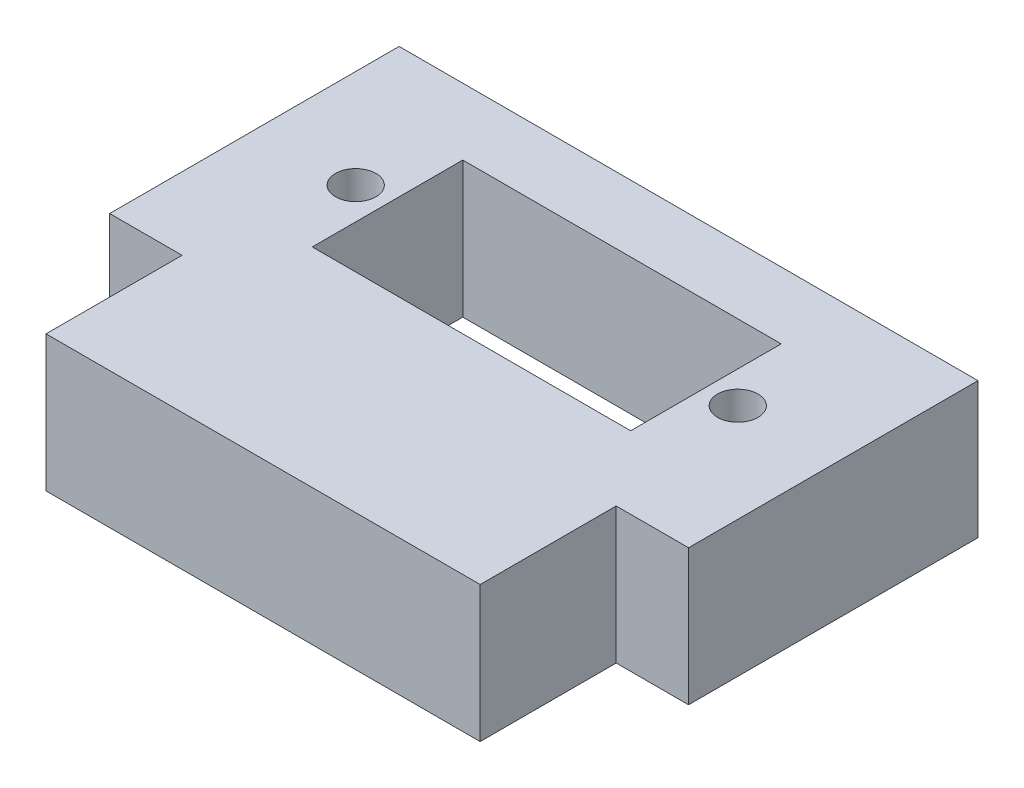
ISO-10303-21;
HEADER;
FILE_DESCRIPTION(('STEP AP214'),'2;1');
FILE_NAME('part.step','',(''),(''),'','','');
FILE_SCHEMA(('AUTOMOTIVE_DESIGN { 1 0 10303 214 1 1 1 1 }'));
ENDSEC;
DATA;
#1=APPLICATION_CONTEXT('core data for automotive mechanical design processes');
#2=APPLICATION_PROTOCOL_DEFINITION('international standard','automotive_design',2000,#1);
#3=PRODUCT_CONTEXT('',#1,'mechanical');
#4=PRODUCT('Part','Part','',(#3));
#5=PRODUCT_RELATED_PRODUCT_CATEGORY('part','',(#4));
#6=PRODUCT_DEFINITION_FORMATION('','',#4);
#7=PRODUCT_DEFINITION_CONTEXT('part definition',#1,'design');
#8=PRODUCT_DEFINITION('design','',#6,#7);
#9=PRODUCT_DEFINITION_SHAPE('','',#8);
#10=(LENGTH_UNIT() NAMED_UNIT(*) SI_UNIT(.MILLI.,.METRE.));
#11=(NAMED_UNIT(*) PLANE_ANGLE_UNIT() SI_UNIT($,.RADIAN.));
#12=(NAMED_UNIT(*) SI_UNIT($,.STERADIAN.) SOLID_ANGLE_UNIT());
#13=UNCERTAINTY_MEASURE_WITH_UNIT(LENGTH_MEASURE(1.E-05),#10,'distance_accuracy_value','');
#14=(GEOMETRIC_REPRESENTATION_CONTEXT(3) GLOBAL_UNCERTAINTY_ASSIGNED_CONTEXT((#13)) GLOBAL_UNIT_ASSIGNED_CONTEXT((#10,
#11,#12)) REPRESENTATION_CONTEXT('',''));
#15=CARTESIAN_POINT('',(0.,0.,0.));
#16=DIRECTION('',(0.,0.,1.));
#17=DIRECTION('',(1.,0.,0.));
#18=AXIS2_PLACEMENT_3D('',#15,#16,#17);
#19=CARTESIAN_POINT('',(0.,11.938,0.));
#20=DIRECTION('',(1.,0.,0.));
#21=DIRECTION('',(0.,0.,-1.));
#22=AXIS2_PLACEMENT_3D('',#19,#20,#21);
#23=PLANE('',#22);
#24=DIRECTION('',(0.,0.,1.));
#25=VECTOR('',#24,1.);
#26=CARTESIAN_POINT('',(0.,0.,0.));
#27=LINE('',#26,#25);
#28=CARTESIAN_POINT('',(0.,0.,-25.4));
#29=VERTEX_POINT('',#28);
#30=CARTESIAN_POINT('',(0.,0.,0.));
#31=VERTEX_POINT('',#30);
#32=EDGE_CURVE('E160',#29,#31,#27,.T.);
#33=ORIENTED_EDGE('',*,*,#32,.T.);
#34=DIRECTION('',(0.,-1.,0.));
#35=VECTOR('',#34,1.);
#36=CARTESIAN_POINT('',(0.,11.938,0.));
#37=LINE('',#36,#35);
#38=CARTESIAN_POINT('',(0.,11.938,0.));
#39=VERTEX_POINT('',#38);
#40=EDGE_CURVE('E11',#39,#31,#37,.T.);
#41=ORIENTED_EDGE('',*,*,#40,.F.);
#42=DIRECTION('',(0.,0.,1.));
#43=VECTOR('',#42,1.);
#44=CARTESIAN_POINT('',(0.,11.938,0.));
#45=LINE('',#44,#43);
#46=CARTESIAN_POINT('',(0.,11.938,-25.4));
#47=VERTEX_POINT('',#46);
#48=EDGE_CURVE('E164',#47,#39,#45,.T.);
#49=ORIENTED_EDGE('',*,*,#48,.F.);
#50=DIRECTION('',(0.,-1.,0.));
#51=VECTOR('',#50,1.);
#52=CARTESIAN_POINT('',(0.,11.938,-25.4));
#53=LINE('',#52,#51);
#54=EDGE_CURVE('E182',#47,#29,#53,.T.);
#55=ORIENTED_EDGE('',*,*,#54,.T.);
#56=EDGE_LOOP('',(#33,#41,#49,#55));
#57=FACE_BOUND('',#56,.T.);
#58=ADVANCED_FACE('F35',(#57),#23,.F.);
#59=CARTESIAN_POINT('',(0.,11.938,0.));
#60=DIRECTION('',(0.,0.,-1.));
#61=DIRECTION('',(-1.,0.,0.));
#62=AXIS2_PLACEMENT_3D('',#59,#60,#61);
#63=PLANE('',#62);
#64=DIRECTION('',(1.,0.,0.));
#65=VECTOR('',#64,1.);
#66=CARTESIAN_POINT('',(0.,0.,0.));
#67=LINE('',#66,#65);
#68=CARTESIAN_POINT('',(6.35,0.,0.));
#69=VERTEX_POINT('',#68);
#70=EDGE_CURVE('E185',#31,#69,#67,.T.);
#71=ORIENTED_EDGE('',*,*,#70,.T.);
#72=DIRECTION('',(0.,-1.,0.));
#73=VECTOR('',#72,1.);
#74=CARTESIAN_POINT('',(6.35,11.938,0.));
#75=LINE('',#74,#73);
#76=CARTESIAN_POINT('',(6.35,11.938,0.));
#77=VERTEX_POINT('',#76);
#78=EDGE_CURVE('E42',#77,#69,#75,.T.);
#79=ORIENTED_EDGE('',*,*,#78,.F.);
#80=DIRECTION('',(1.,0.,0.));
#81=VECTOR('',#80,1.);
#82=CARTESIAN_POINT('',(0.,11.938,0.));
#83=LINE('',#82,#81);
#84=EDGE_CURVE('E167',#39,#77,#83,.T.);
#85=ORIENTED_EDGE('',*,*,#84,.F.);
#86=ORIENTED_EDGE('',*,*,#40,.T.);
#87=EDGE_LOOP('',(#71,#79,#85,#86));
#88=FACE_BOUND('',#87,.T.);
#89=ADVANCED_FACE('F240',(#88),#63,.F.);
#90=CARTESIAN_POINT('',(6.35,11.938,0.));
#91=DIRECTION('',(1.,0.,0.));
#92=DIRECTION('',(0.,0.,-1.));
#93=AXIS2_PLACEMENT_3D('',#90,#91,#92);
#94=PLANE('',#93);
#95=DIRECTION('',(0.,0.,1.));
#96=VECTOR('',#95,1.);
#97=CARTESIAN_POINT('',(6.35,0.,0.));
#98=LINE('',#97,#96);
#99=CARTESIAN_POINT('',(6.35,0.,11.938));
#100=VERTEX_POINT('',#99);
#101=EDGE_CURVE('E187',#69,#100,#98,.T.);
#102=ORIENTED_EDGE('',*,*,#101,.T.);
#103=DIRECTION('',(0.,-1.,0.));
#104=VECTOR('',#103,1.);
#105=CARTESIAN_POINT('',(6.35,11.938,11.938));
#106=LINE('',#105,#104);
#107=CARTESIAN_POINT('',(6.35,11.938,11.938));
#108=VERTEX_POINT('',#107);
#109=EDGE_CURVE('E212',#108,#100,#106,.T.);
#110=ORIENTED_EDGE('',*,*,#109,.F.);
#111=DIRECTION('',(0.,0.,1.));
#112=VECTOR('',#111,1.);
#113=CARTESIAN_POINT('',(6.35,11.938,0.));
#114=LINE('',#113,#112);
#115=EDGE_CURVE('E170',#77,#108,#114,.T.);
#116=ORIENTED_EDGE('',*,*,#115,.F.);
#117=ORIENTED_EDGE('',*,*,#78,.T.);
#118=EDGE_LOOP('',(#102,#110,#116,#117));
#119=FACE_BOUND('',#118,.T.);
#120=ADVANCED_FACE('F219',(#119),#94,.F.);
#121=CARTESIAN_POINT('',(6.35,11.938,11.938));
#122=DIRECTION('',(0.,0.,-1.));
#123=DIRECTION('',(-1.,0.,0.));
#124=AXIS2_PLACEMENT_3D('',#121,#122,#123);
#125=PLANE('',#124);
#126=DIRECTION('',(1.,0.,0.));
#127=VECTOR('',#126,1.);
#128=CARTESIAN_POINT('',(6.35,0.,11.938));
#129=LINE('',#128,#127);
#130=CARTESIAN_POINT('',(44.45,0.,11.938));
#131=VERTEX_POINT('',#130);
#132=EDGE_CURVE('E189',#100,#131,#129,.T.);
#133=ORIENTED_EDGE('',*,*,#132,.T.);
#134=DIRECTION('',(0.,-1.,0.));
#135=VECTOR('',#134,1.);
#136=CARTESIAN_POINT('',(44.45,11.938,11.938));
#137=LINE('',#136,#135);
#138=CARTESIAN_POINT('',(44.45,11.938,11.938));
#139=VERTEX_POINT('',#138);
#140=EDGE_CURVE('E209',#139,#131,#137,.T.);
#141=ORIENTED_EDGE('',*,*,#140,.F.);
#142=DIRECTION('',(1.,0.,0.));
#143=VECTOR('',#142,1.);
#144=CARTESIAN_POINT('',(6.35,11.938,11.938));
#145=LINE('',#144,#143);
#146=EDGE_CURVE('E172',#108,#139,#145,.T.);
#147=ORIENTED_EDGE('',*,*,#146,.F.);
#148=ORIENTED_EDGE('',*,*,#109,.T.);
#149=EDGE_LOOP('',(#133,#141,#147,#148));
#150=FACE_BOUND('',#149,.T.);
#151=ADVANCED_FACE('F228',(#150),#125,.F.);
#152=CARTESIAN_POINT('',(44.45,11.938,0.));
#153=DIRECTION('',(-1.,0.,0.));
#154=DIRECTION('',(0.,0.,1.));
#155=AXIS2_PLACEMENT_3D('',#152,#153,#154);
#156=PLANE('',#155);
#157=DIRECTION('',(0.,0.,-1.));
#158=VECTOR('',#157,1.);
#159=CARTESIAN_POINT('',(44.45,0.,0.));
#160=LINE('',#159,#158);
#161=CARTESIAN_POINT('',(44.45,0.,0.));
#162=VERTEX_POINT('',#161);
#163=EDGE_CURVE('E191',#131,#162,#160,.T.);
#164=ORIENTED_EDGE('',*,*,#163,.T.);
#165=DIRECTION('',(0.,-1.,0.));
#166=VECTOR('',#165,1.);
#167=CARTESIAN_POINT('',(44.45,11.938,0.));
#168=LINE('',#167,#166);
#169=CARTESIAN_POINT('',(44.45,11.938,0.));
#170=VERTEX_POINT('',#169);
#171=EDGE_CURVE('E206',#170,#162,#168,.T.);
#172=ORIENTED_EDGE('',*,*,#171,.F.);
#173=DIRECTION('',(0.,0.,-1.));
#174=VECTOR('',#173,1.);
#175=CARTESIAN_POINT('',(44.45,11.938,0.));
#176=LINE('',#175,#174);
#177=EDGE_CURVE('E174',#139,#170,#176,.T.);
#178=ORIENTED_EDGE('',*,*,#177,.F.);
#179=ORIENTED_EDGE('',*,*,#140,.T.);
#180=EDGE_LOOP('',(#164,#172,#178,#179));
#181=FACE_BOUND('',#180,.T.);
#182=ADVANCED_FACE('F232',(#181),#156,.F.);
#183=CARTESIAN_POINT('',(44.45,11.938,0.));
#184=DIRECTION('',(0.,0.,-1.));
#185=DIRECTION('',(-1.,0.,0.));
#186=AXIS2_PLACEMENT_3D('',#183,#184,#185);
#187=PLANE('',#186);
#188=DIRECTION('',(1.,0.,0.));
#189=VECTOR('',#188,1.);
#190=CARTESIAN_POINT('',(44.45,0.,0.));
#191=LINE('',#190,#189);
#192=CARTESIAN_POINT('',(50.8,0.,0.));
#193=VERTEX_POINT('',#192);
#194=EDGE_CURVE('E193',#162,#193,#191,.T.);
#195=ORIENTED_EDGE('',*,*,#194,.T.);
#196=DIRECTION('',(0.,-1.,0.));
#197=VECTOR('',#196,1.);
#198=CARTESIAN_POINT('',(50.8,11.938,0.));
#199=LINE('',#198,#197);
#200=CARTESIAN_POINT('',(50.8,11.938,0.));
#201=VERTEX_POINT('',#200);
#202=EDGE_CURVE('E203',#201,#193,#199,.T.);
#203=ORIENTED_EDGE('',*,*,#202,.F.);
#204=DIRECTION('',(1.,0.,0.));
#205=VECTOR('',#204,1.);
#206=CARTESIAN_POINT('',(44.45,11.938,0.));
#207=LINE('',#206,#205);
#208=EDGE_CURVE('E176',#170,#201,#207,.T.);
#209=ORIENTED_EDGE('',*,*,#208,.F.);
#210=ORIENTED_EDGE('',*,*,#171,.T.);
#211=EDGE_LOOP('',(#195,#203,#209,#210));
#212=FACE_BOUND('',#211,.T.);
#213=ADVANCED_FACE('F253',(#212),#187,.F.);
#214=CARTESIAN_POINT('',(50.8,11.938,0.));
#215=DIRECTION('',(-1.,0.,0.));
#216=DIRECTION('',(0.,0.,1.));
#217=AXIS2_PLACEMENT_3D('',#214,#215,#216);
#218=PLANE('',#217);
#219=DIRECTION('',(0.,0.,-1.));
#220=VECTOR('',#219,1.);
#221=CARTESIAN_POINT('',(50.8,0.,0.));
#222=LINE('',#221,#220);
#223=CARTESIAN_POINT('',(50.8,0.,-25.4));
#224=VERTEX_POINT('',#223);
#225=EDGE_CURVE('E195',#193,#224,#222,.T.);
#226=ORIENTED_EDGE('',*,*,#225,.T.);
#227=DIRECTION('',(0.,-1.,0.));
#228=VECTOR('',#227,1.);
#229=CARTESIAN_POINT('',(50.8,11.938,-25.4));
#230=LINE('',#229,#228);
#231=CARTESIAN_POINT('',(50.8,11.938,-25.4));
#232=VERTEX_POINT('',#231);
#233=EDGE_CURVE('E200',#232,#224,#230,.T.);
#234=ORIENTED_EDGE('',*,*,#233,.F.);
#235=DIRECTION('',(0.,0.,-1.));
#236=VECTOR('',#235,1.);
#237=CARTESIAN_POINT('',(50.8,11.938,0.));
#238=LINE('',#237,#236);
#239=EDGE_CURVE('E178',#201,#232,#238,.T.);
#240=ORIENTED_EDGE('',*,*,#239,.F.);
#241=ORIENTED_EDGE('',*,*,#202,.T.);
#242=EDGE_LOOP('',(#226,#234,#240,#241));
#243=FACE_BOUND('',#242,.T.);
#244=ADVANCED_FACE('F251',(#243),#218,.F.);
#245=CARTESIAN_POINT('',(0.,11.938,-25.4));
#246=DIRECTION('',(0.,0.,1.));
#247=DIRECTION('',(1.,0.,0.));
#248=AXIS2_PLACEMENT_3D('',#245,#246,#247);
#249=PLANE('',#248);
#250=DIRECTION('',(-1.,0.,0.));
#251=VECTOR('',#250,1.);
#252=CARTESIAN_POINT('',(0.,0.,-25.4));
#253=LINE('',#252,#251);
#254=EDGE_CURVE('E168',#224,#29,#253,.T.);
#255=ORIENTED_EDGE('',*,*,#254,.T.);
#256=ORIENTED_EDGE('',*,*,#54,.F.);
#257=DIRECTION('',(-1.,0.,0.));
#258=VECTOR('',#257,1.);
#259=CARTESIAN_POINT('',(0.,11.938,-25.4));
#260=LINE('',#259,#258);
#261=EDGE_CURVE('E180',#232,#47,#260,.T.);
#262=ORIENTED_EDGE('',*,*,#261,.F.);
#263=ORIENTED_EDGE('',*,*,#233,.T.);
#264=EDGE_LOOP('',(#255,#256,#262,#263));
#265=FACE_BOUND('',#264,.T.);
#266=ADVANCED_FACE('F246',(#265),#249,.F.);
#267=CARTESIAN_POINT('',(0.,11.938,0.));
#268=DIRECTION('',(0.,-1.,0.));
#269=DIRECTION('',(0.,0.,-1.));
#270=AXIS2_PLACEMENT_3D('',#267,#268,#269);
#271=PLANE('',#270);
#272=CARTESIAN_POINT('',(8.636,11.938,-12.954));
#273=DIRECTION('',(0.,1.,0.));
#274=DIRECTION('',(0.,0.,1.));
#275=AXIS2_PLACEMENT_3D('',#272,#273,#274);
#276=CIRCLE('',#275,1.778);
#277=CARTESIAN_POINT('',(8.636,11.938,-11.176));
#278=VERTEX_POINT('',#277);
#279=EDGE_CURVE('E380',#278,#278,#276,.T.);
#280=ORIENTED_EDGE('',*,*,#279,.F.);
#281=EDGE_LOOP('',(#280));
#282=FACE_BOUND('',#281,.T.);
#283=CARTESIAN_POINT('',(42.164,11.938,-12.954));
#284=DIRECTION('',(0.,1.,0.));
#285=DIRECTION('',(0.,0.,-1.));
#286=AXIS2_PLACEMENT_3D('',#283,#284,#285);
#287=CIRCLE('',#286,1.778);
#288=CARTESIAN_POINT('',(42.164,11.938,-14.732));
#289=VERTEX_POINT('',#288);
#290=EDGE_CURVE('E147',#289,#289,#287,.T.);
#291=ORIENTED_EDGE('',*,*,#290,.F.);
#292=EDGE_LOOP('',(#291));
#293=FACE_BOUND('',#292,.T.);
#294=DIRECTION('',(-1.,0.,0.));
#295=VECTOR('',#294,1.);
#296=CARTESIAN_POINT('',(39.37,11.938,-19.558));
#297=LINE('',#296,#295);
#298=CARTESIAN_POINT('',(39.37,11.938,-19.558));
#299=VERTEX_POINT('',#298);
#300=CARTESIAN_POINT('',(11.43,11.938,-19.558));
#301=VERTEX_POINT('',#300);
#302=EDGE_CURVE('E153',#299,#301,#297,.T.);
#303=ORIENTED_EDGE('',*,*,#302,.F.);
#304=DIRECTION('',(0.,0.,-1.));
#305=VECTOR('',#304,1.);
#306=CARTESIAN_POINT('',(39.37,11.938,-6.35));
#307=LINE('',#306,#305);
#308=CARTESIAN_POINT('',(39.37,11.938,-6.35));
#309=VERTEX_POINT('',#308);
#310=EDGE_CURVE('E49',#309,#299,#307,.T.);
#311=ORIENTED_EDGE('',*,*,#310,.F.);
#312=DIRECTION('',(1.,0.,0.));
#313=VECTOR('',#312,1.);
#314=CARTESIAN_POINT('',(39.37,11.938,-6.35));
#315=LINE('',#314,#313);
#316=CARTESIAN_POINT('',(11.43,11.938,-6.35));
#317=VERTEX_POINT('',#316);
#318=EDGE_CURVE('E141',#317,#309,#315,.T.);
#319=ORIENTED_EDGE('',*,*,#318,.F.);
#320=DIRECTION('',(0.,0.,1.));
#321=VECTOR('',#320,1.);
#322=CARTESIAN_POINT('',(11.43,11.938,-6.35));
#323=LINE('',#322,#321);
#324=EDGE_CURVE('E144',#301,#317,#323,.T.);
#325=ORIENTED_EDGE('',*,*,#324,.F.);
#326=EDGE_LOOP('',(#303,#311,#319,#325));
#327=FACE_BOUND('',#326,.T.);
#328=ORIENTED_EDGE('',*,*,#48,.T.);
#329=ORIENTED_EDGE('',*,*,#84,.T.);
#330=ORIENTED_EDGE('',*,*,#115,.T.);
#331=ORIENTED_EDGE('',*,*,#146,.T.);
#332=ORIENTED_EDGE('',*,*,#177,.T.);
#333=ORIENTED_EDGE('',*,*,#208,.T.);
#334=ORIENTED_EDGE('',*,*,#239,.T.);
#335=ORIENTED_EDGE('',*,*,#261,.T.);
#336=EDGE_LOOP('',(#328,#329,#330,#331,#332,#333,#334,#335));
#337=FACE_BOUND('',#336,.T.);
#338=ADVANCED_FACE('F236',(#282,#293,#327,#337),#271,.F.);
#339=CARTESIAN_POINT('',(0.,0.,0.));
#340=DIRECTION('',(0.,-1.,0.));
#341=DIRECTION('',(0.,0.,-1.));
#342=AXIS2_PLACEMENT_3D('',#339,#340,#341);
#343=PLANE('',#342);
#344=CARTESIAN_POINT('',(8.636,0.,-12.954));
#345=DIRECTION('',(0.,1.,0.));
#346=DIRECTION('',(0.,0.,1.));
#347=AXIS2_PLACEMENT_3D('',#344,#345,#346);
#348=CIRCLE('',#347,1.778);
#349=CARTESIAN_POINT('',(8.636,0.,-11.176));
#350=VERTEX_POINT('',#349);
#351=EDGE_CURVE('E154',#350,#350,#348,.T.);
#352=ORIENTED_EDGE('',*,*,#351,.T.);
#353=EDGE_LOOP('',(#352));
#354=FACE_BOUND('',#353,.T.);
#355=CARTESIAN_POINT('',(42.164,0.,-12.954));
#356=DIRECTION('',(0.,1.,0.));
#357=DIRECTION('',(0.,0.,-1.));
#358=AXIS2_PLACEMENT_3D('',#355,#356,#357);
#359=CIRCLE('',#358,1.778);
#360=CARTESIAN_POINT('',(42.164,0.,-14.732));
#361=VERTEX_POINT('',#360);
#362=EDGE_CURVE('E381',#361,#361,#359,.T.);
#363=ORIENTED_EDGE('',*,*,#362,.T.);
#364=EDGE_LOOP('',(#363));
#365=FACE_BOUND('',#364,.T.);
#366=DIRECTION('',(0.,0.,-1.));
#367=VECTOR('',#366,1.);
#368=CARTESIAN_POINT('',(39.37,0.,-6.35));
#369=LINE('',#368,#367);
#370=CARTESIAN_POINT('',(39.37,0.,-6.35));
#371=VERTEX_POINT('',#370);
#372=CARTESIAN_POINT('',(39.37,0.,-19.558));
#373=VERTEX_POINT('',#372);
#374=EDGE_CURVE('E125',#371,#373,#369,.T.);
#375=ORIENTED_EDGE('',*,*,#374,.T.);
#376=DIRECTION('',(-1.,0.,0.));
#377=VECTOR('',#376,1.);
#378=CARTESIAN_POINT('',(39.37,0.,-19.558));
#379=LINE('',#378,#377);
#380=CARTESIAN_POINT('',(11.43,0.,-19.558));
#381=VERTEX_POINT('',#380);
#382=EDGE_CURVE('E134',#373,#381,#379,.T.);
#383=ORIENTED_EDGE('',*,*,#382,.T.);
#384=DIRECTION('',(0.,0.,1.));
#385=VECTOR('',#384,1.);
#386=CARTESIAN_POINT('',(11.43,0.,-6.35));
#387=LINE('',#386,#385);
#388=CARTESIAN_POINT('',(11.43,0.,-6.35));
#389=VERTEX_POINT('',#388);
#390=EDGE_CURVE('E57',#381,#389,#387,.T.);
#391=ORIENTED_EDGE('',*,*,#390,.T.);
#392=DIRECTION('',(1.,0.,0.));
#393=VECTOR('',#392,1.);
#394=CARTESIAN_POINT('',(39.37,0.,-6.35));
#395=LINE('',#394,#393);
#396=EDGE_CURVE('E131',#389,#371,#395,.T.);
#397=ORIENTED_EDGE('',*,*,#396,.T.);
#398=EDGE_LOOP('',(#375,#383,#391,#397));
#399=FACE_BOUND('',#398,.T.);
#400=ORIENTED_EDGE('',*,*,#32,.F.);
#401=ORIENTED_EDGE('',*,*,#254,.F.);
#402=ORIENTED_EDGE('',*,*,#225,.F.);
#403=ORIENTED_EDGE('',*,*,#194,.F.);
#404=ORIENTED_EDGE('',*,*,#163,.F.);
#405=ORIENTED_EDGE('',*,*,#132,.F.);
#406=ORIENTED_EDGE('',*,*,#101,.F.);
#407=ORIENTED_EDGE('',*,*,#70,.F.);
#408=EDGE_LOOP('',(#400,#401,#402,#403,#404,#405,#406,#407));
#409=FACE_BOUND('',#408,.T.);
#410=ADVANCED_FACE('F138',(#354,#365,#399,#409),#343,.T.);
#411=CARTESIAN_POINT('',(39.37,0.,-6.35));
#412=DIRECTION('',(1.,0.,0.));
#413=DIRECTION('',(0.,0.,-1.));
#414=AXIS2_PLACEMENT_3D('',#411,#412,#413);
#415=PLANE('',#414);
#416=ORIENTED_EDGE('',*,*,#310,.T.);
#417=DIRECTION('',(0.,1.,0.));
#418=VECTOR('',#417,1.);
#419=CARTESIAN_POINT('',(39.37,0.,-19.558));
#420=LINE('',#419,#418);
#421=EDGE_CURVE('E121',#373,#299,#420,.T.);
#422=ORIENTED_EDGE('',*,*,#421,.F.);
#423=ORIENTED_EDGE('',*,*,#374,.F.);
#424=DIRECTION('',(0.,1.,0.));
#425=VECTOR('',#424,1.);
#426=CARTESIAN_POINT('',(39.37,0.,-6.35));
#427=LINE('',#426,#425);
#428=EDGE_CURVE('E158',#371,#309,#427,.T.);
#429=ORIENTED_EDGE('',*,*,#428,.T.);
#430=EDGE_LOOP('',(#416,#422,#423,#429));
#431=FACE_BOUND('',#430,.T.);
#432=ADVANCED_FACE('F123',(#431),#415,.F.);
#433=CARTESIAN_POINT('',(39.37,0.,-6.35));
#434=DIRECTION('',(0.,0.,1.));
#435=DIRECTION('',(1.,0.,0.));
#436=AXIS2_PLACEMENT_3D('',#433,#434,#435);
#437=PLANE('',#436);
#438=ORIENTED_EDGE('',*,*,#318,.T.);
#439=ORIENTED_EDGE('',*,*,#428,.F.);
#440=ORIENTED_EDGE('',*,*,#396,.F.);
#441=DIRECTION('',(0.,1.,0.));
#442=VECTOR('',#441,1.);
#443=CARTESIAN_POINT('',(11.43,0.,-6.35));
#444=LINE('',#443,#442);
#445=EDGE_CURVE('E161',#389,#317,#444,.T.);
#446=ORIENTED_EDGE('',*,*,#445,.T.);
#447=EDGE_LOOP('',(#438,#439,#440,#446));
#448=FACE_BOUND('',#447,.T.);
#449=ADVANCED_FACE('F309',(#448),#437,.F.);
#450=CARTESIAN_POINT('',(11.43,0.,-6.35));
#451=DIRECTION('',(-1.,0.,0.));
#452=DIRECTION('',(0.,0.,1.));
#453=AXIS2_PLACEMENT_3D('',#450,#451,#452);
#454=PLANE('',#453);
#455=ORIENTED_EDGE('',*,*,#324,.T.);
#456=ORIENTED_EDGE('',*,*,#445,.F.);
#457=ORIENTED_EDGE('',*,*,#390,.F.);
#458=DIRECTION('',(0.,1.,0.));
#459=VECTOR('',#458,1.);
#460=CARTESIAN_POINT('',(11.43,0.,-19.558));
#461=LINE('',#460,#459);
#462=EDGE_CURVE('E130',#381,#301,#461,.T.);
#463=ORIENTED_EDGE('',*,*,#462,.T.);
#464=EDGE_LOOP('',(#455,#456,#457,#463));
#465=FACE_BOUND('',#464,.T.);
#466=ADVANCED_FACE('F320',(#465),#454,.F.);
#467=CARTESIAN_POINT('',(39.37,0.,-19.558));
#468=DIRECTION('',(0.,0.,-1.));
#469=DIRECTION('',(-1.,0.,0.));
#470=AXIS2_PLACEMENT_3D('',#467,#468,#469);
#471=PLANE('',#470);
#472=ORIENTED_EDGE('',*,*,#302,.T.);
#473=ORIENTED_EDGE('',*,*,#462,.F.);
#474=ORIENTED_EDGE('',*,*,#382,.F.);
#475=ORIENTED_EDGE('',*,*,#421,.T.);
#476=EDGE_LOOP('',(#472,#473,#474,#475));
#477=FACE_BOUND('',#476,.T.);
#478=ADVANCED_FACE('F135',(#477),#471,.F.);
#479=CARTESIAN_POINT('',(42.164,0.,-12.954));
#480=DIRECTION('',(0.,1.,0.));
#481=DIRECTION('',(0.,0.,1.));
#482=AXIS2_PLACEMENT_3D('',#479,#480,#481);
#483=CYLINDRICAL_SURFACE('',#482,1.778);
#484=ORIENTED_EDGE('',*,*,#362,.F.);
#485=EDGE_LOOP('',(#484));
#486=FACE_BOUND('',#485,.T.);
#487=ORIENTED_EDGE('',*,*,#290,.T.);
#488=EDGE_LOOP('',(#487));
#489=FACE_BOUND('',#488,.T.);
#490=ADVANCED_FACE('F338',(#486,#489),#483,.F.);
#491=CARTESIAN_POINT('',(8.636,0.,-12.954));
#492=DIRECTION('',(0.,1.,0.));
#493=DIRECTION('',(0.,0.,1.));
#494=AXIS2_PLACEMENT_3D('',#491,#492,#493);
#495=CYLINDRICAL_SURFACE('',#494,1.778);
#496=ORIENTED_EDGE('',*,*,#351,.F.);
#497=EDGE_LOOP('',(#496));
#498=FACE_BOUND('',#497,.T.);
#499=ORIENTED_EDGE('',*,*,#279,.T.);
#500=EDGE_LOOP('',(#499));
#501=FACE_BOUND('',#500,.T.);
#502=ADVANCED_FACE('F361',(#498,#501),#495,.F.);
#503=CLOSED_SHELL('',(#58,#89,#120,#151,#182,#213,#244,#266,#338,#410,#432,#449,#466,#478,#490,#502));
#504=MANIFOLD_SOLID_BREP('B2',#503);
#505=ADVANCED_BREP_SHAPE_REPRESENTATION('',(#18,#504),#14);
#506=SHAPE_DEFINITION_REPRESENTATION(#9,#505);
ENDSEC;
END-ISO-10303-21;
